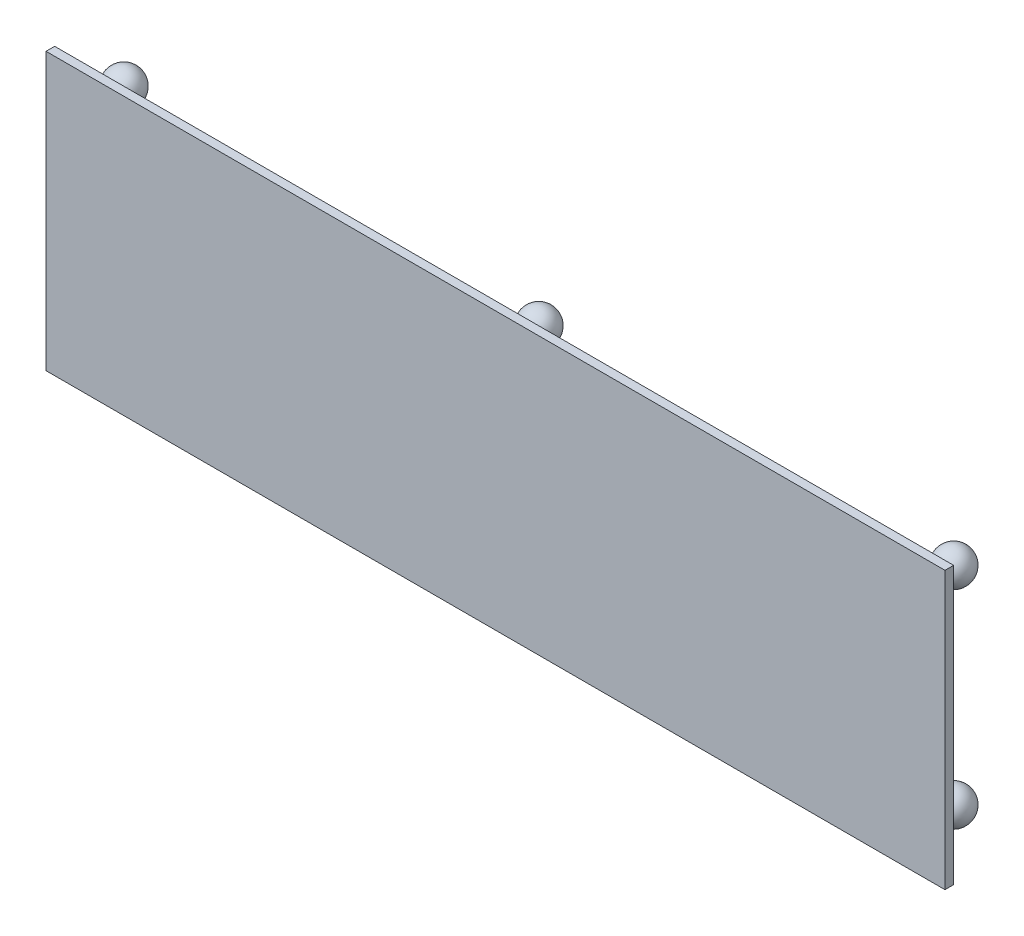
ISO-10303-21;
HEADER;
FILE_DESCRIPTION(('STEP AP214'),'2;1');
FILE_NAME('part.step','',(''),(''),'','','');
FILE_SCHEMA(('AUTOMOTIVE_DESIGN { 1 0 10303 214 1 1 1 1 }'));
ENDSEC;
DATA;
#1=APPLICATION_CONTEXT('core data for automotive mechanical design processes');
#2=APPLICATION_PROTOCOL_DEFINITION('international standard','automotive_design',2000,#1);
#3=PRODUCT_CONTEXT('',#1,'mechanical');
#4=PRODUCT('Part','Part','',(#3));
#5=PRODUCT_RELATED_PRODUCT_CATEGORY('part','',(#4));
#6=PRODUCT_DEFINITION_FORMATION('','',#4);
#7=PRODUCT_DEFINITION_CONTEXT('part definition',#1,'design');
#8=PRODUCT_DEFINITION('design','',#6,#7);
#9=PRODUCT_DEFINITION_SHAPE('','',#8);
#10=(LENGTH_UNIT() NAMED_UNIT(*) SI_UNIT(.MILLI.,.METRE.));
#11=(NAMED_UNIT(*) PLANE_ANGLE_UNIT() SI_UNIT($,.RADIAN.));
#12=(NAMED_UNIT(*) SI_UNIT($,.STERADIAN.) SOLID_ANGLE_UNIT());
#13=UNCERTAINTY_MEASURE_WITH_UNIT(LENGTH_MEASURE(1.E-05),#10,'distance_accuracy_value','');
#14=(GEOMETRIC_REPRESENTATION_CONTEXT(3) GLOBAL_UNCERTAINTY_ASSIGNED_CONTEXT((#13)) GLOBAL_UNIT_ASSIGNED_CONTEXT((#10,
#11,#12)) REPRESENTATION_CONTEXT('',''));
#15=CARTESIAN_POINT('',(0.,0.,0.));
#16=DIRECTION('',(0.,0.,1.));
#17=DIRECTION('',(1.,0.,0.));
#18=AXIS2_PLACEMENT_3D('',#15,#16,#17);
#19=CARTESIAN_POINT('',(330.2,-101.6,6.35));
#20=DIRECTION('',(-1.,0.,0.));
#21=DIRECTION('',(0.,0.,1.));
#22=AXIS2_PLACEMENT_3D('',#19,#20,#21);
#23=PLANE('',#22);
#24=DIRECTION('',(0.,1.,0.));
#25=VECTOR('',#24,1.);
#26=CARTESIAN_POINT('',(330.2,-101.6,0.));
#27=LINE('',#26,#25);
#28=CARTESIAN_POINT('',(330.2,-101.6,0.));
#29=VERTEX_POINT('',#28);
#30=CARTESIAN_POINT('',(330.2,101.6,0.));
#31=VERTEX_POINT('',#30);
#32=EDGE_CURVE('E111',#29,#31,#27,.T.);
#33=ORIENTED_EDGE('',*,*,#32,.T.);
#34=DIRECTION('',(0.,0.,-1.));
#35=VECTOR('',#34,1.);
#36=CARTESIAN_POINT('',(330.2,101.6,6.35));
#37=LINE('',#36,#35);
#38=CARTESIAN_POINT('',(330.2,101.6,6.35));
#39=VERTEX_POINT('',#38);
#40=EDGE_CURVE('E100',#39,#31,#37,.T.);
#41=ORIENTED_EDGE('',*,*,#40,.F.);
#42=DIRECTION('',(0.,1.,0.));
#43=VECTOR('',#42,1.);
#44=CARTESIAN_POINT('',(330.2,-101.6,6.35));
#45=LINE('',#44,#43);
#46=CARTESIAN_POINT('',(330.2,-101.6,6.35));
#47=VERTEX_POINT('',#46);
#48=EDGE_CURVE('E92',#47,#39,#45,.T.);
#49=ORIENTED_EDGE('',*,*,#48,.F.);
#50=DIRECTION('',(0.,0.,-1.));
#51=VECTOR('',#50,1.);
#52=CARTESIAN_POINT('',(330.2,-101.6,6.35));
#53=LINE('',#52,#51);
#54=EDGE_CURVE('E107',#47,#29,#53,.T.);
#55=ORIENTED_EDGE('',*,*,#54,.T.);
#56=EDGE_LOOP('',(#33,#41,#49,#55));
#57=FACE_BOUND('',#56,.T.);
#58=ADVANCED_FACE('F39',(#57),#23,.F.);
#59=CARTESIAN_POINT('',(-330.2,101.6,6.35));
#60=DIRECTION('',(0.,-1.,0.));
#61=DIRECTION('',(0.,0.,-1.));
#62=AXIS2_PLACEMENT_3D('',#59,#60,#61);
#63=PLANE('',#62);
#64=DIRECTION('',(-1.,0.,0.));
#65=VECTOR('',#64,1.);
#66=CARTESIAN_POINT('',(-330.2,101.6,0.));
#67=LINE('',#66,#65);
#68=CARTESIAN_POINT('',(-330.2,101.6,0.));
#69=VERTEX_POINT('',#68);
#70=EDGE_CURVE('E98',#31,#69,#67,.T.);
#71=ORIENTED_EDGE('',*,*,#70,.T.);
#72=DIRECTION('',(0.,0.,-1.));
#73=VECTOR('',#72,1.);
#74=CARTESIAN_POINT('',(-330.2,101.6,6.35));
#75=LINE('',#74,#73);
#76=CARTESIAN_POINT('',(-330.2,101.6,6.35));
#77=VERTEX_POINT('',#76);
#78=EDGE_CURVE('E96',#77,#69,#75,.T.);
#79=ORIENTED_EDGE('',*,*,#78,.F.);
#80=DIRECTION('',(-1.,0.,0.));
#81=VECTOR('',#80,1.);
#82=CARTESIAN_POINT('',(-330.2,101.6,6.35));
#83=LINE('',#82,#81);
#84=EDGE_CURVE('E87',#39,#77,#83,.T.);
#85=ORIENTED_EDGE('',*,*,#84,.F.);
#86=ORIENTED_EDGE('',*,*,#40,.T.);
#87=EDGE_LOOP('',(#71,#79,#85,#86));
#88=FACE_BOUND('',#87,.T.);
#89=ADVANCED_FACE('F97',(#88),#63,.F.);
#90=CARTESIAN_POINT('',(-330.2,-101.6,6.35));
#91=DIRECTION('',(1.,0.,0.));
#92=DIRECTION('',(0.,0.,-1.));
#93=AXIS2_PLACEMENT_3D('',#90,#91,#92);
#94=PLANE('',#93);
#95=DIRECTION('',(0.,-1.,0.));
#96=VECTOR('',#95,1.);
#97=CARTESIAN_POINT('',(-330.2,-101.6,0.));
#98=LINE('',#97,#96);
#99=CARTESIAN_POINT('',(-330.2,-101.6,0.));
#100=VERTEX_POINT('',#99);
#101=EDGE_CURVE('E73',#69,#100,#98,.T.);
#102=ORIENTED_EDGE('',*,*,#101,.T.);
#103=DIRECTION('',(0.,0.,-1.));
#104=VECTOR('',#103,1.);
#105=CARTESIAN_POINT('',(-330.2,-101.6,6.35));
#106=LINE('',#105,#104);
#107=CARTESIAN_POINT('',(-330.2,-101.6,6.35));
#108=VERTEX_POINT('',#107);
#109=EDGE_CURVE('E101',#108,#100,#106,.T.);
#110=ORIENTED_EDGE('',*,*,#109,.F.);
#111=DIRECTION('',(0.,-1.,0.));
#112=VECTOR('',#111,1.);
#113=CARTESIAN_POINT('',(-330.2,-101.6,6.35));
#114=LINE('',#113,#112);
#115=EDGE_CURVE('E90',#77,#108,#114,.T.);
#116=ORIENTED_EDGE('',*,*,#115,.F.);
#117=ORIENTED_EDGE('',*,*,#78,.T.);
#118=EDGE_LOOP('',(#102,#110,#116,#117));
#119=FACE_BOUND('',#118,.T.);
#120=ADVANCED_FACE('F103',(#119),#94,.F.);
#121=CARTESIAN_POINT('',(-330.2,-101.6,6.35));
#122=DIRECTION('',(0.,1.,0.));
#123=DIRECTION('',(0.,0.,1.));
#124=AXIS2_PLACEMENT_3D('',#121,#122,#123);
#125=PLANE('',#124);
#126=DIRECTION('',(1.,0.,0.));
#127=VECTOR('',#126,1.);
#128=CARTESIAN_POINT('',(-330.2,-101.6,0.));
#129=LINE('',#128,#127);
#130=EDGE_CURVE('E79',#100,#29,#129,.T.);
#131=ORIENTED_EDGE('',*,*,#130,.T.);
#132=ORIENTED_EDGE('',*,*,#54,.F.);
#133=DIRECTION('',(1.,0.,0.));
#134=VECTOR('',#133,1.);
#135=CARTESIAN_POINT('',(-330.2,-101.6,6.35));
#136=LINE('',#135,#134);
#137=EDGE_CURVE('E56',#108,#47,#136,.T.);
#138=ORIENTED_EDGE('',*,*,#137,.F.);
#139=ORIENTED_EDGE('',*,*,#109,.T.);
#140=EDGE_LOOP('',(#131,#132,#138,#139));
#141=FACE_BOUND('',#140,.T.);
#142=ADVANCED_FACE('F165',(#141),#125,.F.);
#143=CARTESIAN_POINT('',(0.,0.,6.35));
#144=DIRECTION('',(0.,0.,-1.));
#145=DIRECTION('',(-1.,0.,0.));
#146=AXIS2_PLACEMENT_3D('',#143,#144,#145);
#147=PLANE('',#146);
#148=ORIENTED_EDGE('',*,*,#48,.T.);
#149=ORIENTED_EDGE('',*,*,#84,.T.);
#150=ORIENTED_EDGE('',*,*,#115,.T.);
#151=ORIENTED_EDGE('',*,*,#137,.T.);
#152=EDGE_LOOP('',(#148,#149,#150,#151));
#153=FACE_BOUND('',#152,.T.);
#154=ADVANCED_FACE('F88',(#153),#147,.F.);
#155=CARTESIAN_POINT('',(0.,0.,0.));
#156=DIRECTION('',(0.,0.,-1.));
#157=DIRECTION('',(-1.,0.,0.));
#158=AXIS2_PLACEMENT_3D('',#155,#156,#157);
#159=PLANE('',#158);
#160=CARTESIAN_POINT('',(304.8,76.2,0.));
#161=DIRECTION('',(0.,0.,-1.));
#162=DIRECTION('',(-1.,0.,0.));
#163=AXIS2_PLACEMENT_3D('',#160,#161,#162);
#164=CIRCLE('',#163,5.90930838032629);
#165=CARTESIAN_POINT('',(298.890691619674,76.2,0.));
#166=VERTEX_POINT('',#165);
#167=EDGE_CURVE('E11',#166,#166,#164,.T.);
#168=ORIENTED_EDGE('',*,*,#167,.F.);
#169=EDGE_LOOP('',(#168));
#170=FACE_BOUND('',#169,.T.);
#171=CARTESIAN_POINT('',(-304.8,76.2,0.));
#172=DIRECTION('',(0.,0.,-1.));
#173=DIRECTION('',(-1.,0.,0.));
#174=AXIS2_PLACEMENT_3D('',#171,#172,#173);
#175=CIRCLE('',#174,5.90930838032629);
#176=CARTESIAN_POINT('',(-310.709308380326,76.2,0.));
#177=VERTEX_POINT('',#176);
#178=EDGE_CURVE('E48',#177,#177,#175,.T.);
#179=ORIENTED_EDGE('',*,*,#178,.F.);
#180=EDGE_LOOP('',(#179));
#181=FACE_BOUND('',#180,.T.);
#182=CARTESIAN_POINT('',(304.8,-76.2,0.));
#183=DIRECTION('',(0.,0.,-1.));
#184=DIRECTION('',(-1.,0.,0.));
#185=AXIS2_PLACEMENT_3D('',#182,#183,#184);
#186=CIRCLE('',#185,5.90930838032629);
#187=CARTESIAN_POINT('',(298.890691619674,-76.2,0.));
#188=VERTEX_POINT('',#187);
#189=EDGE_CURVE('E140',#188,#188,#186,.T.);
#190=ORIENTED_EDGE('',*,*,#189,.F.);
#191=EDGE_LOOP('',(#190));
#192=FACE_BOUND('',#191,.T.);
#193=CARTESIAN_POINT('',(-304.8,-76.2,0.));
#194=DIRECTION('',(0.,0.,-1.));
#195=DIRECTION('',(-1.,0.,0.));
#196=AXIS2_PLACEMENT_3D('',#193,#194,#195);
#197=CIRCLE('',#196,5.90930838032629);
#198=CARTESIAN_POINT('',(-310.709308380326,-76.2,0.));
#199=VERTEX_POINT('',#198);
#200=EDGE_CURVE('E136',#199,#199,#197,.T.);
#201=ORIENTED_EDGE('',*,*,#200,.F.);
#202=EDGE_LOOP('',(#201));
#203=FACE_BOUND('',#202,.T.);
#204=CARTESIAN_POINT('',(0.,76.2,0.));
#205=DIRECTION('',(0.,0.,-1.));
#206=DIRECTION('',(-1.,0.,0.));
#207=AXIS2_PLACEMENT_3D('',#204,#205,#206);
#208=CIRCLE('',#207,5.90930838032629);
#209=CARTESIAN_POINT('',(-5.90930838032629,76.2,0.));
#210=VERTEX_POINT('',#209);
#211=EDGE_CURVE('E132',#210,#210,#208,.T.);
#212=ORIENTED_EDGE('',*,*,#211,.F.);
#213=EDGE_LOOP('',(#212));
#214=FACE_BOUND('',#213,.T.);
#215=CARTESIAN_POINT('',(0.,-76.2,0.));
#216=DIRECTION('',(0.,0.,-1.));
#217=DIRECTION('',(-1.,0.,0.));
#218=AXIS2_PLACEMENT_3D('',#215,#216,#217);
#219=CIRCLE('',#218,5.90930838032629);
#220=CARTESIAN_POINT('',(-5.90930838032629,-76.2,0.));
#221=VERTEX_POINT('',#220);
#222=EDGE_CURVE('E128',#221,#221,#219,.T.);
#223=ORIENTED_EDGE('',*,*,#222,.F.);
#224=EDGE_LOOP('',(#223));
#225=FACE_BOUND('',#224,.T.);
#226=ORIENTED_EDGE('',*,*,#32,.F.);
#227=ORIENTED_EDGE('',*,*,#130,.F.);
#228=ORIENTED_EDGE('',*,*,#101,.F.);
#229=ORIENTED_EDGE('',*,*,#70,.F.);
#230=EDGE_LOOP('',(#226,#227,#228,#229));
#231=FACE_BOUND('',#230,.T.);
#232=ADVANCED_FACE('F149',(#170,#181,#192,#203,#214,#225,#231),#159,.T.);
#233=CARTESIAN_POINT('',(0.,-76.2,0.));
#234=DIRECTION('',(0.,0.,1.));
#235=DIRECTION('',(1.,0.,0.));
#236=AXIS2_PLACEMENT_3D('',#233,#234,#235);
#237=CYLINDRICAL_SURFACE('',#236,5.90930838032629);
#238=CARTESIAN_POINT('',(0.,-76.2,-14.1585554991271));
#239=DIRECTION('',(0.,0.,1.));
#240=DIRECTION('',(1.,0.,0.));
#241=AXIS2_PLACEMENT_3D('',#238,#239,#240);
#242=CIRCLE('',#241,5.90930838032629);
#243=CARTESIAN_POINT('',(5.90930838032629,-76.2,-14.1585554991271));
#244=VERTEX_POINT('',#243);
#245=EDGE_CURVE('E115',#244,#244,#242,.T.);
#246=ORIENTED_EDGE('',*,*,#245,.T.);
#247=EDGE_LOOP('',(#246));
#248=FACE_BOUND('',#247,.T.);
#249=ORIENTED_EDGE('',*,*,#222,.T.);
#250=EDGE_LOOP('',(#249));
#251=FACE_BOUND('',#250,.T.);
#252=ADVANCED_FACE('F152',(#248,#251),#237,.T.);
#253=CARTESIAN_POINT('',(0.,-76.2,-25.4));
#254=DIRECTION('',(0.,0.,1.));
#255=DIRECTION('',(0.,-1.,0.));
#256=AXIS2_PLACEMENT_3D('',#253,#254,#255);
#257=SPHERICAL_SURFACE('',#256,12.7);
#258=ORIENTED_EDGE('',*,*,#245,.F.);
#259=EDGE_LOOP('',(#258));
#260=FACE_BOUND('',#259,.T.);
#261=ADVANCED_FACE('F204',(#260),#257,.T.);
#262=CARTESIAN_POINT('',(0.,76.2,0.));
#263=DIRECTION('',(0.,0.,1.));
#264=DIRECTION('',(1.,0.,0.));
#265=AXIS2_PLACEMENT_3D('',#262,#263,#264);
#266=CYLINDRICAL_SURFACE('',#265,5.90930838032629);
#267=CARTESIAN_POINT('',(0.,76.2,-14.1585554991271));
#268=DIRECTION('',(0.,0.,-1.));
#269=DIRECTION('',(1.,0.,0.));
#270=AXIS2_PLACEMENT_3D('',#267,#268,#269);
#271=CIRCLE('',#270,5.90930838032629);
#272=CARTESIAN_POINT('',(5.90930838032629,76.2,-14.1585554991271));
#273=VERTEX_POINT('',#272);
#274=EDGE_CURVE('E340',#273,#273,#271,.T.);
#275=ORIENTED_EDGE('',*,*,#274,.F.);
#276=EDGE_LOOP('',(#275));
#277=FACE_BOUND('',#276,.T.);
#278=ORIENTED_EDGE('',*,*,#211,.T.);
#279=EDGE_LOOP('',(#278));
#280=FACE_BOUND('',#279,.T.);
#281=ADVANCED_FACE('F214',(#277,#280),#266,.T.);
#282=CARTESIAN_POINT('',(0.,76.2,-25.4));
#283=DIRECTION('',(0.,0.,1.));
#284=DIRECTION('',(0.,1.,0.));
#285=AXIS2_PLACEMENT_3D('',#282,#283,#284);
#286=SPHERICAL_SURFACE('',#285,12.7);
#287=ORIENTED_EDGE('',*,*,#274,.T.);
#288=EDGE_LOOP('',(#287));
#289=FACE_BOUND('',#288,.T.);
#290=ADVANCED_FACE('F224',(#289),#286,.T.);
#291=CARTESIAN_POINT('',(-304.8,-76.2,0.));
#292=DIRECTION('',(0.,0.,1.));
#293=DIRECTION('',(1.,0.,0.));
#294=AXIS2_PLACEMENT_3D('',#291,#292,#293);
#295=CYLINDRICAL_SURFACE('',#294,5.90930838032629);
#296=CARTESIAN_POINT('',(-304.8,-76.2,-14.1585554991271));
#297=DIRECTION('',(0.,0.,1.));
#298=DIRECTION('',(1.,0.,0.));
#299=AXIS2_PLACEMENT_3D('',#296,#297,#298);
#300=CIRCLE('',#299,5.90930838032629);
#301=CARTESIAN_POINT('',(-298.890691619674,-76.2,-14.1585554991271));
#302=VERTEX_POINT('',#301);
#303=EDGE_CURVE('E336',#302,#302,#300,.T.);
#304=ORIENTED_EDGE('',*,*,#303,.T.);
#305=EDGE_LOOP('',(#304));
#306=FACE_BOUND('',#305,.T.);
#307=ORIENTED_EDGE('',*,*,#200,.T.);
#308=EDGE_LOOP('',(#307));
#309=FACE_BOUND('',#308,.T.);
#310=ADVANCED_FACE('F234',(#306,#309),#295,.T.);
#311=CARTESIAN_POINT('',(-304.8,-76.2,-25.4));
#312=DIRECTION('',(0.,0.,1.));
#313=DIRECTION('',(0.,-1.,0.));
#314=AXIS2_PLACEMENT_3D('',#311,#312,#313);
#315=SPHERICAL_SURFACE('',#314,12.7);
#316=ORIENTED_EDGE('',*,*,#303,.F.);
#317=EDGE_LOOP('',(#316));
#318=FACE_BOUND('',#317,.T.);
#319=ADVANCED_FACE('F249',(#318),#315,.T.);
#320=CARTESIAN_POINT('',(304.8,-76.2,0.));
#321=DIRECTION('',(0.,0.,1.));
#322=DIRECTION('',(1.,0.,0.));
#323=AXIS2_PLACEMENT_3D('',#320,#321,#322);
#324=CYLINDRICAL_SURFACE('',#323,5.90930838032629);
#325=CARTESIAN_POINT('',(304.8,-76.2,-14.1585554991271));
#326=DIRECTION('',(0.,0.,1.));
#327=DIRECTION('',(1.,0.,0.));
#328=AXIS2_PLACEMENT_3D('',#325,#326,#327);
#329=CIRCLE('',#328,5.90930838032629);
#330=CARTESIAN_POINT('',(310.709308380326,-76.2,-14.1585554991271));
#331=VERTEX_POINT('',#330);
#332=EDGE_CURVE('E330',#331,#331,#329,.T.);
#333=ORIENTED_EDGE('',*,*,#332,.T.);
#334=EDGE_LOOP('',(#333));
#335=FACE_BOUND('',#334,.T.);
#336=ORIENTED_EDGE('',*,*,#189,.T.);
#337=EDGE_LOOP('',(#336));
#338=FACE_BOUND('',#337,.T.);
#339=ADVANCED_FACE('F259',(#335,#338),#324,.T.);
#340=CARTESIAN_POINT('',(304.8,-76.2,-25.4));
#341=DIRECTION('',(0.,0.,1.));
#342=DIRECTION('',(0.,-1.,0.));
#343=AXIS2_PLACEMENT_3D('',#340,#341,#342);
#344=SPHERICAL_SURFACE('',#343,12.7);
#345=ORIENTED_EDGE('',*,*,#332,.F.);
#346=EDGE_LOOP('',(#345));
#347=FACE_BOUND('',#346,.T.);
#348=ADVANCED_FACE('F269',(#347),#344,.T.);
#349=CARTESIAN_POINT('',(-304.8,76.2,0.));
#350=DIRECTION('',(0.,0.,1.));
#351=DIRECTION('',(1.,0.,0.));
#352=AXIS2_PLACEMENT_3D('',#349,#350,#351);
#353=CYLINDRICAL_SURFACE('',#352,5.90930838032629);
#354=CARTESIAN_POINT('',(-304.8,76.2,-14.1585554991271));
#355=DIRECTION('',(0.,0.,-1.));
#356=DIRECTION('',(1.,0.,0.));
#357=AXIS2_PLACEMENT_3D('',#354,#355,#356);
#358=CIRCLE('',#357,5.90930838032629);
#359=CARTESIAN_POINT('',(-298.890691619674,76.2,-14.1585554991271));
#360=VERTEX_POINT('',#359);
#361=EDGE_CURVE('E326',#360,#360,#358,.T.);
#362=ORIENTED_EDGE('',*,*,#361,.F.);
#363=EDGE_LOOP('',(#362));
#364=FACE_BOUND('',#363,.T.);
#365=ORIENTED_EDGE('',*,*,#178,.T.);
#366=EDGE_LOOP('',(#365));
#367=FACE_BOUND('',#366,.T.);
#368=ADVANCED_FACE('F147',(#364,#367),#353,.T.);
#369=CARTESIAN_POINT('',(-304.8,76.2,-25.4));
#370=DIRECTION('',(0.,0.,1.));
#371=DIRECTION('',(0.,1.,0.));
#372=AXIS2_PLACEMENT_3D('',#369,#370,#371);
#373=SPHERICAL_SURFACE('',#372,12.7);
#374=ORIENTED_EDGE('',*,*,#361,.T.);
#375=EDGE_LOOP('',(#374));
#376=FACE_BOUND('',#375,.T.);
#377=ADVANCED_FACE('F288',(#376),#373,.T.);
#378=CARTESIAN_POINT('',(304.8,76.2,0.));
#379=DIRECTION('',(0.,0.,1.));
#380=DIRECTION('',(1.,0.,0.));
#381=AXIS2_PLACEMENT_3D('',#378,#379,#380);
#382=CYLINDRICAL_SURFACE('',#381,5.90930838032629);
#383=CARTESIAN_POINT('',(304.8,76.2,-14.1585554991271));
#384=DIRECTION('',(0.,0.,-1.));
#385=DIRECTION('',(1.,0.,0.));
#386=AXIS2_PLACEMENT_3D('',#383,#384,#385);
#387=CIRCLE('',#386,5.90930838032629);
#388=CARTESIAN_POINT('',(310.709308380326,76.2,-14.1585554991271));
#389=VERTEX_POINT('',#388);
#390=EDGE_CURVE('E324',#389,#389,#387,.T.);
#391=ORIENTED_EDGE('',*,*,#390,.F.);
#392=EDGE_LOOP('',(#391));
#393=FACE_BOUND('',#392,.T.);
#394=ORIENTED_EDGE('',*,*,#167,.T.);
#395=EDGE_LOOP('',(#394));
#396=FACE_BOUND('',#395,.T.);
#397=ADVANCED_FACE('F298',(#393,#396),#382,.T.);
#398=CARTESIAN_POINT('',(304.8,76.2,-25.4));
#399=DIRECTION('',(0.,0.,1.));
#400=DIRECTION('',(0.,1.,0.));
#401=AXIS2_PLACEMENT_3D('',#398,#399,#400);
#402=SPHERICAL_SURFACE('',#401,12.7);
#403=ORIENTED_EDGE('',*,*,#390,.T.);
#404=EDGE_LOOP('',(#403));
#405=FACE_BOUND('',#404,.T.);
#406=ADVANCED_FACE('F308',(#405),#402,.T.);
#407=CLOSED_SHELL('',(#58,#89,#120,#142,#154,#232,#252,#261,#281,#290,#310,#319,#339,#348,#368,
#377,#397,#406));
#408=MANIFOLD_SOLID_BREP('B2',#407);
#409=ADVANCED_BREP_SHAPE_REPRESENTATION('',(#18,#408),#14);
#410=SHAPE_DEFINITION_REPRESENTATION(#9,#409);
ENDSEC;
END-ISO-10303-21;
